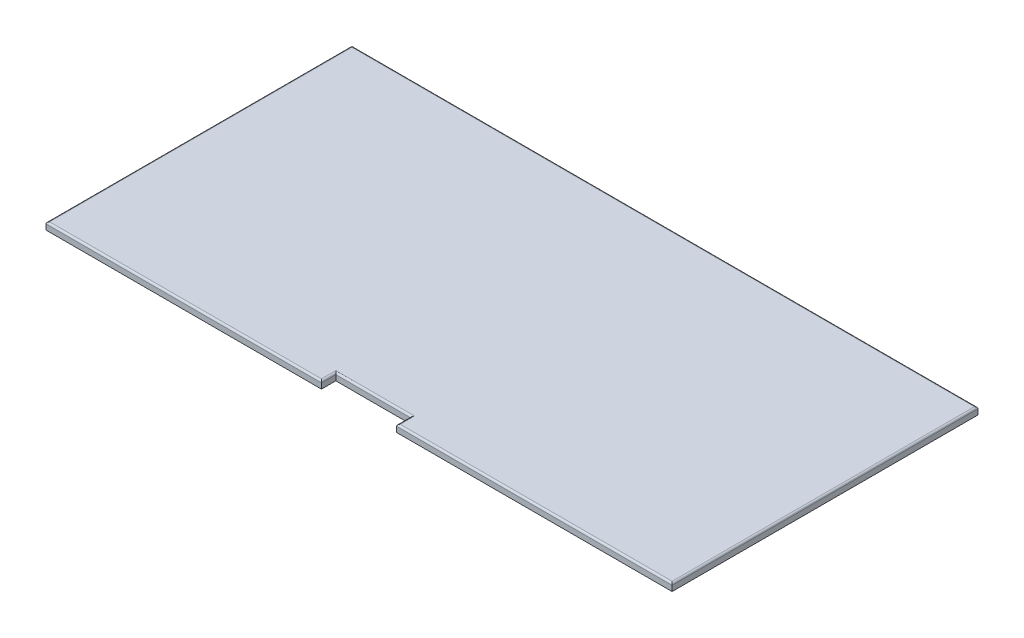
ISO-10303-21;
HEADER;
FILE_DESCRIPTION(('STEP AP214'),'2;1');
FILE_NAME('part.step','',(''),(''),'','','');
FILE_SCHEMA(('AUTOMOTIVE_DESIGN { 1 0 10303 214 1 1 1 1 }'));
ENDSEC;
DATA;
#1=APPLICATION_CONTEXT('core data for automotive mechanical design processes');
#2=APPLICATION_PROTOCOL_DEFINITION('international standard','automotive_design',2000,#1);
#3=PRODUCT_CONTEXT('',#1,'mechanical');
#4=PRODUCT('Part','Part','',(#3));
#5=PRODUCT_RELATED_PRODUCT_CATEGORY('part','',(#4));
#6=PRODUCT_DEFINITION_FORMATION('','',#4);
#7=PRODUCT_DEFINITION_CONTEXT('part definition',#1,'design');
#8=PRODUCT_DEFINITION('design','',#6,#7);
#9=PRODUCT_DEFINITION_SHAPE('','',#8);
#10=(LENGTH_UNIT() NAMED_UNIT(*) SI_UNIT(.MILLI.,.METRE.));
#11=(NAMED_UNIT(*) PLANE_ANGLE_UNIT() SI_UNIT($,.RADIAN.));
#12=(NAMED_UNIT(*) SI_UNIT($,.STERADIAN.) SOLID_ANGLE_UNIT());
#13=UNCERTAINTY_MEASURE_WITH_UNIT(LENGTH_MEASURE(1.E-05),#10,'distance_accuracy_value','');
#14=(GEOMETRIC_REPRESENTATION_CONTEXT(3) GLOBAL_UNCERTAINTY_ASSIGNED_CONTEXT((#13)) GLOBAL_UNIT_ASSIGNED_CONTEXT((#10,
#11,#12)) REPRESENTATION_CONTEXT('',''));
#15=CARTESIAN_POINT('',(0.,0.,0.));
#16=DIRECTION('',(0.,0.,1.));
#17=DIRECTION('',(1.,0.,0.));
#18=AXIS2_PLACEMENT_3D('',#15,#16,#17);
#19=CARTESIAN_POINT('',(-875.,20.,427.5));
#20=DIRECTION('',(0.,0.,-1.));
#21=DIRECTION('',(-1.,0.,0.));
#22=AXIS2_PLACEMENT_3D('',#19,#20,#21);
#23=PLANE('',#22);
#24=DIRECTION('',(0.,-1.,0.));
#25=VECTOR('',#24,1.);
#26=CARTESIAN_POINT('',(875.,20.,427.5));
#27=LINE('',#26,#25);
#28=CARTESIAN_POINT('',(875.,15.,427.5));
#29=VERTEX_POINT('',#28);
#30=CARTESIAN_POINT('',(875.,0.,427.5));
#31=VERTEX_POINT('',#30);
#32=EDGE_CURVE('E230',#29,#31,#27,.T.);
#33=ORIENTED_EDGE('',*,*,#32,.F.);
#34=DIRECTION('',(1.,0.,0.));
#35=VECTOR('',#34,1.);
#36=CARTESIAN_POINT('',(105.,15.,427.5));
#37=LINE('',#36,#35);
#38=CARTESIAN_POINT('',(105.,15.,427.5));
#39=VERTEX_POINT('',#38);
#40=EDGE_CURVE('E44',#29,#39,#37,.F.);
#41=ORIENTED_EDGE('',*,*,#40,.T.);
#42=DIRECTION('',(0.,-1.,0.));
#43=VECTOR('',#42,1.);
#44=CARTESIAN_POINT('',(105.,20.,427.5));
#45=LINE('',#44,#43);
#46=CARTESIAN_POINT('',(105.,0.,427.5));
#47=VERTEX_POINT('',#46);
#48=EDGE_CURVE('E229',#39,#47,#45,.T.);
#49=ORIENTED_EDGE('',*,*,#48,.T.);
#50=DIRECTION('',(1.,0.,0.));
#51=VECTOR('',#50,1.);
#52=CARTESIAN_POINT('',(-875.,0.,427.5));
#53=LINE('',#52,#51);
#54=EDGE_CURVE('E150',#47,#31,#53,.T.);
#55=ORIENTED_EDGE('',*,*,#54,.T.);
#56=EDGE_LOOP('',(#33,#41,#49,#55));
#57=FACE_BOUND('',#56,.T.);
#58=ADVANCED_FACE('F35',(#57),#23,.F.);
#59=CARTESIAN_POINT('',(875.,20.,-427.5));
#60=DIRECTION('',(-1.,0.,0.));
#61=DIRECTION('',(0.,0.,1.));
#62=AXIS2_PLACEMENT_3D('',#59,#60,#61);
#63=PLANE('',#62);
#64=DIRECTION('',(0.,-1.,0.));
#65=VECTOR('',#64,1.);
#66=CARTESIAN_POINT('',(875.,20.,-427.5));
#67=LINE('',#66,#65);
#68=CARTESIAN_POINT('',(875.,15.,-427.5));
#69=VERTEX_POINT('',#68);
#70=CARTESIAN_POINT('',(875.,0.,-427.5));
#71=VERTEX_POINT('',#70);
#72=EDGE_CURVE('E151',#69,#71,#67,.T.);
#73=ORIENTED_EDGE('',*,*,#72,.F.);
#74=DIRECTION('',(0.,0.,-1.));
#75=VECTOR('',#74,1.);
#76=CARTESIAN_POINT('',(875.,15.,427.5));
#77=LINE('',#76,#75);
#78=EDGE_CURVE('E179',#69,#29,#77,.F.);
#79=ORIENTED_EDGE('',*,*,#78,.T.);
#80=ORIENTED_EDGE('',*,*,#32,.T.);
#81=DIRECTION('',(0.,0.,-1.));
#82=VECTOR('',#81,1.);
#83=CARTESIAN_POINT('',(875.,0.,-427.5));
#84=LINE('',#83,#82);
#85=EDGE_CURVE('E231',#31,#71,#84,.T.);
#86=ORIENTED_EDGE('',*,*,#85,.T.);
#87=EDGE_LOOP('',(#73,#79,#80,#86));
#88=FACE_BOUND('',#87,.T.);
#89=ADVANCED_FACE('F284',(#88),#63,.F.);
#90=CARTESIAN_POINT('',(-875.,20.,-427.5));
#91=DIRECTION('',(0.,0.,1.));
#92=DIRECTION('',(1.,0.,0.));
#93=AXIS2_PLACEMENT_3D('',#90,#91,#92);
#94=PLANE('',#93);
#95=DIRECTION('',(0.,-1.,0.));
#96=VECTOR('',#95,1.);
#97=CARTESIAN_POINT('',(-875.,20.,-427.5));
#98=LINE('',#97,#96);
#99=CARTESIAN_POINT('',(-875.,15.,-427.5));
#100=VERTEX_POINT('',#99);
#101=CARTESIAN_POINT('',(-875.,0.,-427.5));
#102=VERTEX_POINT('',#101);
#103=EDGE_CURVE('E155',#100,#102,#98,.T.);
#104=ORIENTED_EDGE('',*,*,#103,.F.);
#105=DIRECTION('',(-1.,0.,0.));
#106=VECTOR('',#105,1.);
#107=CARTESIAN_POINT('',(875.,15.,-427.5));
#108=LINE('',#107,#106);
#109=EDGE_CURVE('E181',#100,#69,#108,.F.);
#110=ORIENTED_EDGE('',*,*,#109,.T.);
#111=ORIENTED_EDGE('',*,*,#72,.T.);
#112=DIRECTION('',(-1.,0.,0.));
#113=VECTOR('',#112,1.);
#114=CARTESIAN_POINT('',(-875.,0.,-427.5));
#115=LINE('',#114,#113);
#116=EDGE_CURVE('E235',#71,#102,#115,.T.);
#117=ORIENTED_EDGE('',*,*,#116,.T.);
#118=EDGE_LOOP('',(#104,#110,#111,#117));
#119=FACE_BOUND('',#118,.T.);
#120=ADVANCED_FACE('F254',(#119),#94,.F.);
#121=CARTESIAN_POINT('',(-875.,20.,-427.5));
#122=DIRECTION('',(1.,0.,0.));
#123=DIRECTION('',(0.,0.,-1.));
#124=AXIS2_PLACEMENT_3D('',#121,#122,#123);
#125=PLANE('',#124);
#126=DIRECTION('',(0.,-1.,0.));
#127=VECTOR('',#126,1.);
#128=CARTESIAN_POINT('',(-875.,20.,427.5));
#129=LINE('',#128,#127);
#130=CARTESIAN_POINT('',(-875.,15.,427.5));
#131=VERTEX_POINT('',#130);
#132=CARTESIAN_POINT('',(-875.,0.,427.5));
#133=VERTEX_POINT('',#132);
#134=EDGE_CURVE('E248',#131,#133,#129,.T.);
#135=ORIENTED_EDGE('',*,*,#134,.F.);
#136=DIRECTION('',(0.,0.,1.));
#137=VECTOR('',#136,1.);
#138=CARTESIAN_POINT('',(-875.,15.,-427.5));
#139=LINE('',#138,#137);
#140=EDGE_CURVE('E57',#131,#100,#139,.F.);
#141=ORIENTED_EDGE('',*,*,#140,.T.);
#142=ORIENTED_EDGE('',*,*,#103,.T.);
#143=DIRECTION('',(0.,0.,1.));
#144=VECTOR('',#143,1.);
#145=CARTESIAN_POINT('',(-875.,0.,-427.5));
#146=LINE('',#145,#144);
#147=EDGE_CURVE('E241',#102,#133,#146,.T.);
#148=ORIENTED_EDGE('',*,*,#147,.T.);
#149=EDGE_LOOP('',(#135,#141,#142,#148));
#150=FACE_BOUND('',#149,.T.);
#151=ADVANCED_FACE('F249',(#150),#125,.F.);
#152=DIRECTION('',(0.,1.,0.));
#153=VECTOR('',#152,1.);
#154=CARTESIAN_POINT('',(-105.,20.,427.5));
#155=LINE('',#154,#153);
#156=CARTESIAN_POINT('',(-105.,0.,427.5));
#157=VERTEX_POINT('',#156);
#158=CARTESIAN_POINT('',(-105.,15.,427.5));
#159=VERTEX_POINT('',#158);
#160=EDGE_CURVE('E232',#157,#159,#155,.T.);
#161=ORIENTED_EDGE('',*,*,#160,.T.);
#162=DIRECTION('',(1.,0.,0.));
#163=VECTOR('',#162,1.);
#164=CARTESIAN_POINT('',(-875.,15.,427.5));
#165=LINE('',#164,#163);
#166=EDGE_CURVE('E11',#159,#131,#165,.F.);
#167=ORIENTED_EDGE('',*,*,#166,.T.);
#168=ORIENTED_EDGE('',*,*,#134,.T.);
#169=EDGE_CURVE('E244',#133,#157,#53,.T.);
#170=ORIENTED_EDGE('',*,*,#169,.T.);
#171=EDGE_LOOP('',(#161,#167,#168,#170));
#172=FACE_BOUND('',#171,.T.);
#173=ADVANCED_FACE('F256',(#172),#23,.F.);
#174=CARTESIAN_POINT('',(0.,20.,0.));
#175=DIRECTION('',(0.,1.,0.));
#176=DIRECTION('',(0.,0.,1.));
#177=AXIS2_PLACEMENT_3D('',#174,#175,#176);
#178=PLANE('',#177);
#179=DIRECTION('',(0.,0.,-1.));
#180=VECTOR('',#179,1.);
#181=CARTESIAN_POINT('',(110.,20.,427.5));
#182=LINE('',#181,#180);
#183=CARTESIAN_POINT('',(110.,20.,382.5));
#184=VERTEX_POINT('',#183);
#185=CARTESIAN_POINT('',(110.,20.,422.5));
#186=VERTEX_POINT('',#185);
#187=EDGE_CURVE('E170',#184,#186,#182,.F.);
#188=ORIENTED_EDGE('',*,*,#187,.T.);
#189=DIRECTION('',(1.,0.,0.));
#190=VECTOR('',#189,1.);
#191=CARTESIAN_POINT('',(875.,20.,422.5));
#192=LINE('',#191,#190);
#193=CARTESIAN_POINT('',(870.,20.,422.5));
#194=VERTEX_POINT('',#193);
#195=EDGE_CURVE('E173',#186,#194,#192,.T.);
#196=ORIENTED_EDGE('',*,*,#195,.T.);
#197=DIRECTION('',(0.,0.,-1.));
#198=VECTOR('',#197,1.);
#199=CARTESIAN_POINT('',(870.,20.,-427.5));
#200=LINE('',#199,#198);
#201=CARTESIAN_POINT('',(870.,20.,-422.5));
#202=VERTEX_POINT('',#201);
#203=EDGE_CURVE('E164',#194,#202,#200,.T.);
#204=ORIENTED_EDGE('',*,*,#203,.T.);
#205=DIRECTION('',(-1.,0.,0.));
#206=VECTOR('',#205,1.);
#207=CARTESIAN_POINT('',(-875.,20.,-422.5));
#208=LINE('',#207,#206);
#209=CARTESIAN_POINT('',(-870.,20.,-422.5));
#210=VERTEX_POINT('',#209);
#211=EDGE_CURVE('E162',#202,#210,#208,.T.);
#212=ORIENTED_EDGE('',*,*,#211,.T.);
#213=DIRECTION('',(0.,0.,1.));
#214=VECTOR('',#213,1.);
#215=CARTESIAN_POINT('',(-870.,20.,427.5));
#216=LINE('',#215,#214);
#217=CARTESIAN_POINT('',(-870.,20.,422.5));
#218=VERTEX_POINT('',#217);
#219=EDGE_CURVE('E160',#210,#218,#216,.T.);
#220=ORIENTED_EDGE('',*,*,#219,.T.);
#221=DIRECTION('',(1.,0.,0.));
#222=VECTOR('',#221,1.);
#223=CARTESIAN_POINT('',(-105.,20.,422.5));
#224=LINE('',#223,#222);
#225=CARTESIAN_POINT('',(-110.,20.,422.5));
#226=VERTEX_POINT('',#225);
#227=EDGE_CURVE('E153',#218,#226,#224,.T.);
#228=ORIENTED_EDGE('',*,*,#227,.T.);
#229=DIRECTION('',(0.,0.,1.));
#230=VECTOR('',#229,1.);
#231=CARTESIAN_POINT('',(-110.,20.,387.5));
#232=LINE('',#231,#230);
#233=CARTESIAN_POINT('',(-110.,20.,382.5));
#234=VERTEX_POINT('',#233);
#235=EDGE_CURVE('E166',#226,#234,#232,.F.);
#236=ORIENTED_EDGE('',*,*,#235,.T.);
#237=DIRECTION('',(-1.,0.,0.));
#238=VECTOR('',#237,1.);
#239=CARTESIAN_POINT('',(105.,20.,382.5));
#240=LINE('',#239,#238);
#241=EDGE_CURVE('E168',#234,#184,#240,.F.);
#242=ORIENTED_EDGE('',*,*,#241,.T.);
#243=EDGE_LOOP('',(#188,#196,#204,#212,#220,#228,#236,#242));
#244=FACE_BOUND('',#243,.T.);
#245=ADVANCED_FACE('F215',(#244),#178,.T.);
#246=CARTESIAN_POINT('',(0.,0.,0.));
#247=DIRECTION('',(0.,1.,0.));
#248=DIRECTION('',(0.,0.,1.));
#249=AXIS2_PLACEMENT_3D('',#246,#247,#248);
#250=PLANE('',#249);
#251=ORIENTED_EDGE('',*,*,#54,.F.);
#252=DIRECTION('',(0.,0.,-1.));
#253=VECTOR('',#252,1.);
#254=CARTESIAN_POINT('',(105.,0.,0.));
#255=LINE('',#254,#253);
#256=CARTESIAN_POINT('',(105.,0.,387.5));
#257=VERTEX_POINT('',#256);
#258=EDGE_CURVE('E131',#47,#257,#255,.T.);
#259=ORIENTED_EDGE('',*,*,#258,.T.);
#260=DIRECTION('',(-1.,0.,0.));
#261=VECTOR('',#260,1.);
#262=CARTESIAN_POINT('',(-105.,0.,387.5));
#263=LINE('',#262,#261);
#264=CARTESIAN_POINT('',(-105.,0.,387.5));
#265=VERTEX_POINT('',#264);
#266=EDGE_CURVE('E141',#257,#265,#263,.T.);
#267=ORIENTED_EDGE('',*,*,#266,.T.);
#268=DIRECTION('',(0.,0.,1.));
#269=VECTOR('',#268,1.);
#270=CARTESIAN_POINT('',(-105.,0.,387.5));
#271=LINE('',#270,#269);
#272=EDGE_CURVE('E137',#265,#157,#271,.T.);
#273=ORIENTED_EDGE('',*,*,#272,.T.);
#274=ORIENTED_EDGE('',*,*,#169,.F.);
#275=ORIENTED_EDGE('',*,*,#147,.F.);
#276=ORIENTED_EDGE('',*,*,#116,.F.);
#277=ORIENTED_EDGE('',*,*,#85,.F.);
#278=EDGE_LOOP('',(#251,#259,#267,#273,#274,#275,#276,#277));
#279=FACE_BOUND('',#278,.T.);
#280=ADVANCED_FACE('F147',(#279),#250,.F.);
#281=CARTESIAN_POINT('',(105.,0.,387.5));
#282=DIRECTION('',(1.,0.,0.));
#283=DIRECTION('',(0.,0.,-1.));
#284=AXIS2_PLACEMENT_3D('',#281,#282,#283);
#285=PLANE('',#284);
#286=ORIENTED_EDGE('',*,*,#48,.F.);
#287=DIRECTION('',(0.,0.,-1.));
#288=VECTOR('',#287,1.);
#289=CARTESIAN_POINT('',(105.,15.,387.5));
#290=LINE('',#289,#288);
#291=CARTESIAN_POINT('',(105.,15.,387.5));
#292=VERTEX_POINT('',#291);
#293=EDGE_CURVE('E134',#39,#292,#290,.T.);
#294=ORIENTED_EDGE('',*,*,#293,.T.);
#295=DIRECTION('',(0.,1.,0.));
#296=VECTOR('',#295,1.);
#297=CARTESIAN_POINT('',(105.,0.,387.5));
#298=LINE('',#297,#296);
#299=EDGE_CURVE('E126',#257,#292,#298,.T.);
#300=ORIENTED_EDGE('',*,*,#299,.F.);
#301=ORIENTED_EDGE('',*,*,#258,.F.);
#302=EDGE_LOOP('',(#286,#294,#300,#301));
#303=FACE_BOUND('',#302,.T.);
#304=ADVANCED_FACE('F129',(#303),#285,.F.);
#305=CARTESIAN_POINT('',(-105.,0.,387.5));
#306=DIRECTION('',(-1.,0.,0.));
#307=DIRECTION('',(0.,0.,1.));
#308=AXIS2_PLACEMENT_3D('',#305,#306,#307);
#309=PLANE('',#308);
#310=DIRECTION('',(0.,1.,0.));
#311=VECTOR('',#310,1.);
#312=CARTESIAN_POINT('',(-105.,0.,387.5));
#313=LINE('',#312,#311);
#314=CARTESIAN_POINT('',(-105.,15.,387.5));
#315=VERTEX_POINT('',#314);
#316=EDGE_CURVE('E136',#265,#315,#313,.T.);
#317=ORIENTED_EDGE('',*,*,#316,.T.);
#318=DIRECTION('',(0.,0.,1.));
#319=VECTOR('',#318,1.);
#320=CARTESIAN_POINT('',(-105.,15.,427.5));
#321=LINE('',#320,#319);
#322=EDGE_CURVE('E177',#315,#159,#321,.T.);
#323=ORIENTED_EDGE('',*,*,#322,.T.);
#324=ORIENTED_EDGE('',*,*,#160,.F.);
#325=ORIENTED_EDGE('',*,*,#272,.F.);
#326=EDGE_LOOP('',(#317,#323,#324,#325));
#327=FACE_BOUND('',#326,.T.);
#328=ADVANCED_FACE('F272',(#327),#309,.F.);
#329=CARTESIAN_POINT('',(-105.,0.,387.5));
#330=DIRECTION('',(0.,0.,-1.));
#331=DIRECTION('',(-1.,0.,0.));
#332=AXIS2_PLACEMENT_3D('',#329,#330,#331);
#333=PLANE('',#332);
#334=ORIENTED_EDGE('',*,*,#299,.T.);
#335=DIRECTION('',(-1.,0.,0.));
#336=VECTOR('',#335,1.);
#337=CARTESIAN_POINT('',(-105.,15.,387.5));
#338=LINE('',#337,#336);
#339=EDGE_CURVE('E175',#292,#315,#338,.T.);
#340=ORIENTED_EDGE('',*,*,#339,.T.);
#341=ORIENTED_EDGE('',*,*,#316,.F.);
#342=ORIENTED_EDGE('',*,*,#266,.F.);
#343=EDGE_LOOP('',(#334,#340,#341,#342));
#344=FACE_BOUND('',#343,.T.);
#345=ADVANCED_FACE('F142',(#344),#333,.F.);
#346=CARTESIAN_POINT('',(-870.,15.,2.25940124309681E-13));
#347=DIRECTION('',(0.,0.,-1.));
#348=DIRECTION('',(-1.,0.,0.));
#349=AXIS2_PLACEMENT_3D('',#346,#347,#348);
#350=CYLINDRICAL_SURFACE('',#349,5.);
#351=CARTESIAN_POINT('',(-870.,15.,422.5));
#352=DIRECTION('',(-0.707106781186548,0.,-0.707106781186547));
#353=DIRECTION('',(-0.707106781186547,0.,0.707106781186548));
#354=AXIS2_PLACEMENT_3D('',#351,#352,#353);
#355=ELLIPSE('',#354,7.07106781186547,5.);
#356=EDGE_CURVE('E200',#218,#131,#355,.F.);
#357=ORIENTED_EDGE('',*,*,#356,.F.);
#358=ORIENTED_EDGE('',*,*,#219,.F.);
#359=CARTESIAN_POINT('',(-870.,15.,-422.5));
#360=DIRECTION('',(0.707106781186547,0.,-0.707106781186548));
#361=DIRECTION('',(-0.707106781186548,0.,-0.707106781186547));
#362=AXIS2_PLACEMENT_3D('',#359,#360,#361);
#363=ELLIPSE('',#362,7.07106781186548,5.);
#364=EDGE_CURVE('E39',#100,#210,#363,.T.);
#365=ORIENTED_EDGE('',*,*,#364,.F.);
#366=ORIENTED_EDGE('',*,*,#140,.F.);
#367=EDGE_LOOP('',(#357,#358,#365,#366));
#368=FACE_BOUND('',#367,.T.);
#369=ADVANCED_FACE('F37',(#368),#350,.T.);
#370=CARTESIAN_POINT('',(0.,15.,-422.5));
#371=DIRECTION('',(1.,0.,0.));
#372=DIRECTION('',(0.,0.,-1.));
#373=AXIS2_PLACEMENT_3D('',#370,#371,#372);
#374=CYLINDRICAL_SURFACE('',#373,5.);
#375=ORIENTED_EDGE('',*,*,#364,.T.);
#376=ORIENTED_EDGE('',*,*,#211,.F.);
#377=CARTESIAN_POINT('',(870.,15.,-422.5));
#378=DIRECTION('',(0.707106781186548,0.,0.707106781186547));
#379=DIRECTION('',(0.707106781186547,0.,-0.707106781186548));
#380=AXIS2_PLACEMENT_3D('',#377,#378,#379);
#381=ELLIPSE('',#380,7.07106781186547,5.);
#382=EDGE_CURVE('E198',#69,#202,#381,.T.);
#383=ORIENTED_EDGE('',*,*,#382,.F.);
#384=ORIENTED_EDGE('',*,*,#109,.F.);
#385=EDGE_LOOP('',(#375,#376,#383,#384));
#386=FACE_BOUND('',#385,.T.);
#387=ADVANCED_FACE('F210',(#386),#374,.T.);
#388=CARTESIAN_POINT('',(0.,15.,422.5));
#389=DIRECTION('',(-1.,0.,0.));
#390=DIRECTION('',(0.,0.,1.));
#391=AXIS2_PLACEMENT_3D('',#388,#389,#390);
#392=CYLINDRICAL_SURFACE('',#391,5.);
#393=ORIENTED_EDGE('',*,*,#356,.T.);
#394=ORIENTED_EDGE('',*,*,#166,.F.);
#395=CARTESIAN_POINT('',(-110.,15.,422.5));
#396=DIRECTION('',(-0.707106781186547,0.,0.707106781186548));
#397=DIRECTION('',(-0.707106781186548,0.,-0.707106781186547));
#398=AXIS2_PLACEMENT_3D('',#395,#396,#397);
#399=ELLIPSE('',#398,7.07106781186548,5.);
#400=EDGE_CURVE('E195',#226,#159,#399,.F.);
#401=ORIENTED_EDGE('',*,*,#400,.F.);
#402=ORIENTED_EDGE('',*,*,#227,.F.);
#403=EDGE_LOOP('',(#393,#394,#401,#402));
#404=FACE_BOUND('',#403,.T.);
#405=ADVANCED_FACE('F258',(#404),#392,.T.);
#406=CARTESIAN_POINT('',(870.,15.,-2.25940124309681E-13));
#407=DIRECTION('',(0.,0.,1.));
#408=DIRECTION('',(1.,0.,0.));
#409=AXIS2_PLACEMENT_3D('',#406,#407,#408);
#410=CYLINDRICAL_SURFACE('',#409,5.);
#411=ORIENTED_EDGE('',*,*,#382,.T.);
#412=ORIENTED_EDGE('',*,*,#203,.F.);
#413=CARTESIAN_POINT('',(870.,15.,422.5));
#414=DIRECTION('',(-0.707106781186547,0.,0.707106781186548));
#415=DIRECTION('',(-0.707106781186548,0.,-0.707106781186547));
#416=AXIS2_PLACEMENT_3D('',#413,#414,#415);
#417=ELLIPSE('',#416,7.07106781186548,5.);
#418=EDGE_CURVE('E192',#29,#194,#417,.T.);
#419=ORIENTED_EDGE('',*,*,#418,.F.);
#420=ORIENTED_EDGE('',*,*,#78,.F.);
#421=EDGE_LOOP('',(#411,#412,#419,#420));
#422=FACE_BOUND('',#421,.T.);
#423=ADVANCED_FACE('F221',(#422),#410,.T.);
#424=CARTESIAN_POINT('',(-110.,15.,387.5));
#425=DIRECTION('',(0.,0.,-1.));
#426=DIRECTION('',(-1.,0.,0.));
#427=AXIS2_PLACEMENT_3D('',#424,#425,#426);
#428=CYLINDRICAL_SURFACE('',#427,5.);
#429=ORIENTED_EDGE('',*,*,#400,.T.);
#430=ORIENTED_EDGE('',*,*,#322,.F.);
#431=CARTESIAN_POINT('',(-110.,15.,382.5));
#432=DIRECTION('',(0.707106781186547,0.,-0.707106781186548));
#433=DIRECTION('',(0.707106781186548,0.,0.707106781186547));
#434=AXIS2_PLACEMENT_3D('',#431,#432,#433);
#435=ELLIPSE('',#434,7.07106781186548,5.);
#436=EDGE_CURVE('E189',#234,#315,#435,.T.);
#437=ORIENTED_EDGE('',*,*,#436,.F.);
#438=ORIENTED_EDGE('',*,*,#235,.F.);
#439=EDGE_LOOP('',(#429,#430,#437,#438));
#440=FACE_BOUND('',#439,.T.);
#441=ADVANCED_FACE('F262',(#440),#428,.T.);
#442=CARTESIAN_POINT('',(0.,15.,422.5));
#443=DIRECTION('',(-1.,0.,0.));
#444=DIRECTION('',(0.,0.,1.));
#445=AXIS2_PLACEMENT_3D('',#442,#443,#444);
#446=CYLINDRICAL_SURFACE('',#445,5.);
#447=ORIENTED_EDGE('',*,*,#418,.T.);
#448=ORIENTED_EDGE('',*,*,#195,.F.);
#449=CARTESIAN_POINT('',(110.,15.,422.5));
#450=DIRECTION('',(-0.707106781186548,0.,-0.707106781186547));
#451=DIRECTION('',(-0.707106781186547,0.,0.707106781186548));
#452=AXIS2_PLACEMENT_3D('',#449,#450,#451);
#453=ELLIPSE('',#452,7.07106781186547,5.);
#454=EDGE_CURVE('E187',#39,#186,#453,.T.);
#455=ORIENTED_EDGE('',*,*,#454,.F.);
#456=ORIENTED_EDGE('',*,*,#40,.F.);
#457=EDGE_LOOP('',(#447,#448,#455,#456));
#458=FACE_BOUND('',#457,.T.);
#459=ADVANCED_FACE('F225',(#458),#446,.T.);
#460=CARTESIAN_POINT('',(-105.,15.,382.5));
#461=DIRECTION('',(1.,0.,0.));
#462=DIRECTION('',(0.,0.,-1.));
#463=AXIS2_PLACEMENT_3D('',#460,#461,#462);
#464=CYLINDRICAL_SURFACE('',#463,5.);
#465=ORIENTED_EDGE('',*,*,#436,.T.);
#466=ORIENTED_EDGE('',*,*,#339,.F.);
#467=CARTESIAN_POINT('',(110.,15.,382.5));
#468=DIRECTION('',(0.707106781186548,0.,0.707106781186547));
#469=DIRECTION('',(-0.707106781186547,0.,0.707106781186548));
#470=AXIS2_PLACEMENT_3D('',#467,#468,#469);
#471=ELLIPSE('',#470,7.07106781186547,5.);
#472=EDGE_CURVE('E185',#184,#292,#471,.T.);
#473=ORIENTED_EDGE('',*,*,#472,.F.);
#474=ORIENTED_EDGE('',*,*,#241,.F.);
#475=EDGE_LOOP('',(#465,#466,#473,#474));
#476=FACE_BOUND('',#475,.T.);
#477=ADVANCED_FACE('F271',(#476),#464,.T.);
#478=CARTESIAN_POINT('',(110.,15.,387.5));
#479=DIRECTION('',(0.,0.,1.));
#480=DIRECTION('',(1.,0.,0.));
#481=AXIS2_PLACEMENT_3D('',#478,#479,#480);
#482=CYLINDRICAL_SURFACE('',#481,5.);
#483=ORIENTED_EDGE('',*,*,#454,.T.);
#484=ORIENTED_EDGE('',*,*,#187,.F.);
#485=ORIENTED_EDGE('',*,*,#472,.T.);
#486=ORIENTED_EDGE('',*,*,#293,.F.);
#487=EDGE_LOOP('',(#483,#484,#485,#486));
#488=FACE_BOUND('',#487,.T.);
#489=ADVANCED_FACE('F269',(#488),#482,.T.);
#490=CLOSED_SHELL('',(#58,#89,#120,#151,#173,#245,#280,#304,#328,#345,#369,#387,#405,#423,#441,
#459,#477,#489));
#491=MANIFOLD_SOLID_BREP('B2',#490);
#492=ADVANCED_BREP_SHAPE_REPRESENTATION('',(#18,#491),#14);
#493=SHAPE_DEFINITION_REPRESENTATION(#9,#492);
ENDSEC;
END-ISO-10303-21;
